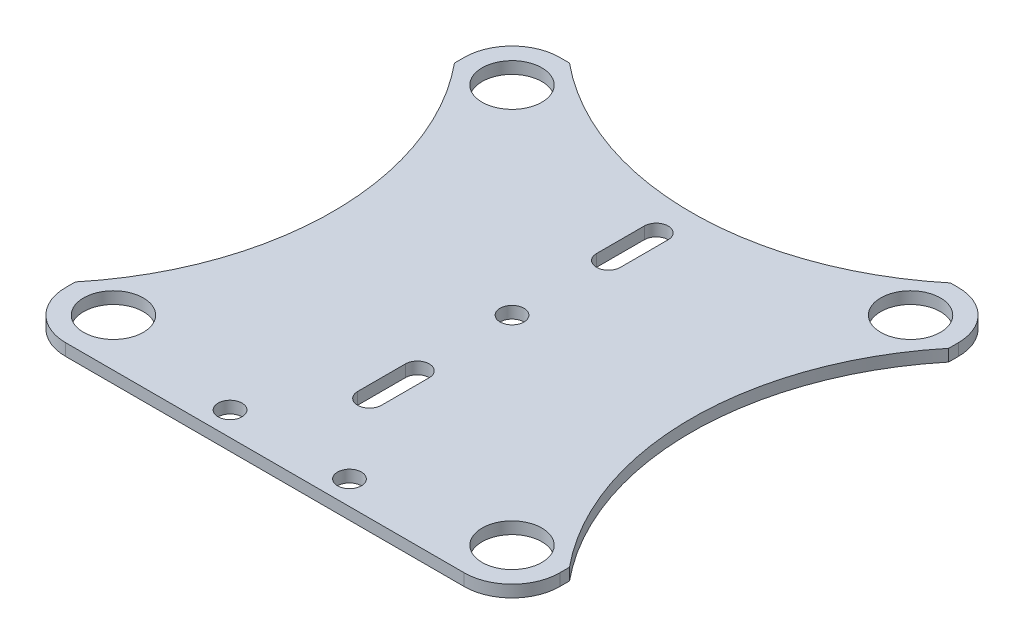
ISO-10303-21;
HEADER;
FILE_DESCRIPTION(('STEP AP214'),'2;1');
FILE_NAME('part.step','',(''),(''),'','','');
FILE_SCHEMA(('AUTOMOTIVE_DESIGN { 1 0 10303 214 1 1 1 1 }'));
ENDSEC;
DATA;
#1=APPLICATION_CONTEXT('core data for automotive mechanical design processes');
#2=APPLICATION_PROTOCOL_DEFINITION('international standard','automotive_design',2000,#1);
#3=PRODUCT_CONTEXT('',#1,'mechanical');
#4=PRODUCT('Part','Part','',(#3));
#5=PRODUCT_RELATED_PRODUCT_CATEGORY('part','',(#4));
#6=PRODUCT_DEFINITION_FORMATION('','',#4);
#7=PRODUCT_DEFINITION_CONTEXT('part definition',#1,'design');
#8=PRODUCT_DEFINITION('design','',#6,#7);
#9=PRODUCT_DEFINITION_SHAPE('','',#8);
#10=(LENGTH_UNIT() NAMED_UNIT(*) SI_UNIT(.MILLI.,.METRE.));
#11=(NAMED_UNIT(*) PLANE_ANGLE_UNIT() SI_UNIT($,.RADIAN.));
#12=(NAMED_UNIT(*) SI_UNIT($,.STERADIAN.) SOLID_ANGLE_UNIT());
#13=UNCERTAINTY_MEASURE_WITH_UNIT(LENGTH_MEASURE(1.E-05),#10,'distance_accuracy_value','');
#14=(GEOMETRIC_REPRESENTATION_CONTEXT(3) GLOBAL_UNCERTAINTY_ASSIGNED_CONTEXT((#13)) GLOBAL_UNIT_ASSIGNED_CONTEXT((#10,
#11,#12)) REPRESENTATION_CONTEXT('',''));
#15=CARTESIAN_POINT('',(0.,0.,0.));
#16=DIRECTION('',(0.,0.,1.));
#17=DIRECTION('',(1.,0.,0.));
#18=AXIS2_PLACEMENT_3D('',#15,#16,#17);
#19=CARTESIAN_POINT('',(80.,2.,0.));
#20=DIRECTION('',(0.,1.,0.));
#21=DIRECTION('',(0.,0.,1.));
#22=AXIS2_PLACEMENT_3D('',#19,#20,#21);
#23=PLANE('',#22);
#24=CARTESIAN_POINT('',(10.1477705862413,2.,37.3612752502187));
#25=DIRECTION('',(0.,1.,0.));
#26=DIRECTION('',(0.,0.,1.));
#27=AXIS2_PLACEMENT_3D('',#24,#25,#26);
#28=CIRCLE('',#27,2.);
#29=CARTESIAN_POINT('',(10.1477705862413,2.,39.3612752502187));
#30=VERTEX_POINT('',#29);
#31=EDGE_CURVE('E710',#30,#30,#28,.T.);
#32=ORIENTED_EDGE('',*,*,#31,.F.);
#33=EDGE_LOOP('',(#32));
#34=FACE_BOUND('',#33,.T.);
#35=CARTESIAN_POINT('',(33.3689380525236,2.,33.3689380525236));
#36=DIRECTION('',(0.,1.,0.));
#37=DIRECTION('',(0.,0.,1.));
#38=AXIS2_PLACEMENT_3D('',#35,#36,#37);
#39=CIRCLE('',#38,5.);
#40=CARTESIAN_POINT('',(33.3689380525236,2.,38.3689380525236));
#41=VERTEX_POINT('',#40);
#42=EDGE_CURVE('E722',#41,#41,#39,.T.);
#43=ORIENTED_EDGE('',*,*,#42,.F.);
#44=EDGE_LOOP('',(#43));
#45=FACE_BOUND('',#44,.T.);
#46=CARTESIAN_POINT('',(33.3689380525236,2.,-33.3689380525236));
#47=DIRECTION('',(0.,1.,0.));
#48=DIRECTION('',(0.,0.,1.));
#49=AXIS2_PLACEMENT_3D('',#46,#47,#48);
#50=CIRCLE('',#49,5.);
#51=CARTESIAN_POINT('',(33.3689380525236,2.,-28.3689380525236));
#52=VERTEX_POINT('',#51);
#53=EDGE_CURVE('E734',#52,#52,#50,.T.);
#54=ORIENTED_EDGE('',*,*,#53,.F.);
#55=EDGE_LOOP('',(#54));
#56=FACE_BOUND('',#55,.T.);
#57=DIRECTION('',(0.,0.,-1.));
#58=VECTOR('',#57,1.);
#59=CARTESIAN_POINT('',(2.14777058624126,2.,24.));
#60=LINE('',#59,#58);
#61=CARTESIAN_POINT('',(2.14777058624126,2.,24.));
#62=VERTEX_POINT('',#61);
#63=CARTESIAN_POINT('',(2.14777058624126,2.,16.));
#64=VERTEX_POINT('',#63);
#65=EDGE_CURVE('E190',#62,#64,#60,.T.);
#66=ORIENTED_EDGE('',*,*,#65,.F.);
#67=CARTESIAN_POINT('',(0.147770586241265,2.,24.));
#68=DIRECTION('',(0.,1.,0.));
#69=DIRECTION('',(0.,0.,1.));
#70=AXIS2_PLACEMENT_3D('',#67,#68,#69);
#71=CIRCLE('',#70,2.);
#72=CARTESIAN_POINT('',(-1.85222941375874,2.,24.));
#73=VERTEX_POINT('',#72);
#74=EDGE_CURVE('E182',#73,#62,#71,.T.);
#75=ORIENTED_EDGE('',*,*,#74,.F.);
#76=DIRECTION('',(0.,0.,1.));
#77=VECTOR('',#76,1.);
#78=CARTESIAN_POINT('',(-1.85222941375874,2.,24.));
#79=LINE('',#78,#77);
#80=CARTESIAN_POINT('',(-1.85222941375873,2.,16.));
#81=VERTEX_POINT('',#80);
#82=EDGE_CURVE('E205',#81,#73,#79,.T.);
#83=ORIENTED_EDGE('',*,*,#82,.F.);
#84=CARTESIAN_POINT('',(0.147770586241264,2.,16.));
#85=DIRECTION('',(0.,1.,0.));
#86=DIRECTION('',(0.,0.,1.));
#87=AXIS2_PLACEMENT_3D('',#84,#85,#86);
#88=CIRCLE('',#87,2.);
#89=EDGE_CURVE('E203',#64,#81,#88,.T.);
#90=ORIENTED_EDGE('',*,*,#89,.F.);
#91=EDGE_LOOP('',(#66,#75,#83,#90));
#92=FACE_BOUND('',#91,.T.);
#93=DIRECTION('',(0.,0.,1.));
#94=VECTOR('',#93,1.);
#95=CARTESIAN_POINT('',(-1.85222941375874,2.,-24.));
#96=LINE('',#95,#94);
#97=CARTESIAN_POINT('',(-1.85222941375874,2.,-24.));
#98=VERTEX_POINT('',#97);
#99=CARTESIAN_POINT('',(-1.85222941375874,2.,-16.));
#100=VERTEX_POINT('',#99);
#101=EDGE_CURVE('E223',#98,#100,#96,.T.);
#102=ORIENTED_EDGE('',*,*,#101,.F.);
#103=CARTESIAN_POINT('',(0.14777058624126,2.,-24.));
#104=DIRECTION('',(0.,1.,0.));
#105=DIRECTION('',(0.,0.,1.));
#106=AXIS2_PLACEMENT_3D('',#103,#104,#105);
#107=CIRCLE('',#106,2.);
#108=CARTESIAN_POINT('',(2.14777058624126,2.,-24.));
#109=VERTEX_POINT('',#108);
#110=EDGE_CURVE('E221',#109,#98,#107,.T.);
#111=ORIENTED_EDGE('',*,*,#110,.F.);
#112=DIRECTION('',(0.,0.,-1.));
#113=VECTOR('',#112,1.);
#114=CARTESIAN_POINT('',(2.14777058624126,2.,-24.));
#115=LINE('',#114,#113);
#116=CARTESIAN_POINT('',(2.14777058624126,2.,-16.));
#117=VERTEX_POINT('',#116);
#118=EDGE_CURVE('E229',#117,#109,#115,.T.);
#119=ORIENTED_EDGE('',*,*,#118,.F.);
#120=CARTESIAN_POINT('',(0.14777058624126,2.,-16.));
#121=DIRECTION('',(0.,1.,0.));
#122=DIRECTION('',(0.,0.,1.));
#123=AXIS2_PLACEMENT_3D('',#120,#121,#122);
#124=CIRCLE('',#123,2.);
#125=EDGE_CURVE('E226',#100,#117,#124,.T.);
#126=ORIENTED_EDGE('',*,*,#125,.F.);
#127=EDGE_LOOP('',(#102,#111,#119,#126));
#128=FACE_BOUND('',#127,.T.);
#129=CARTESIAN_POINT('',(80.,2.,0.));
#130=DIRECTION('',(0.,-1.,0.));
#131=DIRECTION('',(0.,0.,1.));
#132=AXIS2_PLACEMENT_3D('',#129,#130,#131);
#133=CIRCLE('',#132,50.);
#134=CARTESIAN_POINT('',(41.3689380525236,2.,31.7433623425472));
#135=VERTEX_POINT('',#134);
#136=CARTESIAN_POINT('',(41.3689380525236,2.,-31.7433623425472));
#137=VERTEX_POINT('',#136);
#138=EDGE_CURVE('E252',#135,#137,#133,.T.);
#139=ORIENTED_EDGE('',*,*,#138,.T.);
#140=DIRECTION('',(0.,0.,-1.));
#141=VECTOR('',#140,1.);
#142=CARTESIAN_POINT('',(41.3689380525236,2.,-31.7433623425472));
#143=LINE('',#142,#141);
#144=CARTESIAN_POINT('',(41.3689380525236,2.,-33.3689380525236));
#145=VERTEX_POINT('',#144);
#146=EDGE_CURVE('E255',#137,#145,#143,.T.);
#147=ORIENTED_EDGE('',*,*,#146,.T.);
#148=CARTESIAN_POINT('',(33.3689380525236,2.,-33.3689380525236));
#149=DIRECTION('',(0.,1.,0.));
#150=DIRECTION('',(0.,0.,-1.));
#151=AXIS2_PLACEMENT_3D('',#148,#149,#150);
#152=CIRCLE('',#151,8.);
#153=CARTESIAN_POINT('',(33.3689380525236,2.,-41.3689380525236));
#154=VERTEX_POINT('',#153);
#155=EDGE_CURVE('E258',#145,#154,#152,.T.);
#156=ORIENTED_EDGE('',*,*,#155,.T.);
#157=DIRECTION('',(-1.,0.,0.));
#158=VECTOR('',#157,1.);
#159=CARTESIAN_POINT('',(32.0389035150297,2.,-41.3689380525236));
#160=LINE('',#159,#158);
#161=CARTESIAN_POINT('',(32.0389035150297,2.,-41.3689380525236));
#162=VERTEX_POINT('',#161);
#163=EDGE_CURVE('E260',#154,#162,#160,.T.);
#164=ORIENTED_EDGE('',*,*,#163,.T.);
#165=CARTESIAN_POINT('',(0.147770586241252,2.,-79.9998635239701));
#166=DIRECTION('',(0.,-1.,0.));
#167=DIRECTION('',(0.,0.,1.));
#168=AXIS2_PLACEMENT_3D('',#165,#166,#167);
#169=CIRCLE('',#168,50.0938395639834);
#170=CARTESIAN_POINT('',(-31.7433623425472,2.,-41.3689380525236));
#171=VERTEX_POINT('',#170);
#172=EDGE_CURVE('E262',#162,#171,#169,.T.);
#173=ORIENTED_EDGE('',*,*,#172,.T.);
#174=DIRECTION('',(-1.,0.,0.));
#175=VECTOR('',#174,1.);
#176=CARTESIAN_POINT('',(-33.3689380525236,2.,-41.3689380525236));
#177=LINE('',#176,#175);
#178=CARTESIAN_POINT('',(-33.3689380525236,2.,-41.3689380525236));
#179=VERTEX_POINT('',#178);
#180=EDGE_CURVE('E264',#171,#179,#177,.T.);
#181=ORIENTED_EDGE('',*,*,#180,.T.);
#182=CARTESIAN_POINT('',(-33.3689380525236,2.,-33.3689380525236));
#183=DIRECTION('',(0.,1.,0.));
#184=DIRECTION('',(0.,0.,-1.));
#185=AXIS2_PLACEMENT_3D('',#182,#183,#184);
#186=CIRCLE('',#185,8.);
#187=CARTESIAN_POINT('',(-41.3689380525236,2.,-33.3689380525236));
#188=VERTEX_POINT('',#187);
#189=EDGE_CURVE('E266',#179,#188,#186,.T.);
#190=ORIENTED_EDGE('',*,*,#189,.T.);
#191=DIRECTION('',(0.,0.,1.));
#192=VECTOR('',#191,1.);
#193=CARTESIAN_POINT('',(-41.3689380525236,2.,-31.7433623425472));
#194=LINE('',#193,#192);
#195=CARTESIAN_POINT('',(-41.3689380525236,2.,-31.7433623425472));
#196=VERTEX_POINT('',#195);
#197=EDGE_CURVE('E268',#188,#196,#194,.T.);
#198=ORIENTED_EDGE('',*,*,#197,.T.);
#199=CARTESIAN_POINT('',(-80.,2.,0.));
#200=DIRECTION('',(0.,-1.,0.));
#201=DIRECTION('',(0.,0.,1.));
#202=AXIS2_PLACEMENT_3D('',#199,#200,#201);
#203=CIRCLE('',#202,50.);
#204=CARTESIAN_POINT('',(-41.3689380525236,2.,31.7433623425472));
#205=VERTEX_POINT('',#204);
#206=EDGE_CURVE('E270',#196,#205,#203,.T.);
#207=ORIENTED_EDGE('',*,*,#206,.T.);
#208=DIRECTION('',(0.,0.,1.));
#209=VECTOR('',#208,1.);
#210=CARTESIAN_POINT('',(-41.3689380525236,2.,33.3689380525236));
#211=LINE('',#210,#209);
#212=CARTESIAN_POINT('',(-41.3689380525236,2.,33.3689380525236));
#213=VERTEX_POINT('',#212);
#214=EDGE_CURVE('E272',#205,#213,#211,.T.);
#215=ORIENTED_EDGE('',*,*,#214,.T.);
#216=CARTESIAN_POINT('',(-33.3689380525236,2.,33.3689380525236));
#217=DIRECTION('',(0.,1.,0.));
#218=DIRECTION('',(0.,0.,1.));
#219=AXIS2_PLACEMENT_3D('',#216,#217,#218);
#220=CIRCLE('',#219,8.);
#221=CARTESIAN_POINT('',(-33.3689380525236,2.,41.3689380525236));
#222=VERTEX_POINT('',#221);
#223=EDGE_CURVE('E274',#213,#222,#220,.T.);
#224=ORIENTED_EDGE('',*,*,#223,.T.);
#225=DIRECTION('',(1.,0.,0.));
#226=VECTOR('',#225,1.);
#227=CARTESIAN_POINT('',(-33.3689380525236,2.,41.3689380525236));
#228=LINE('',#227,#226);
#229=CARTESIAN_POINT('',(33.3689380525236,2.,41.3689380525236));
#230=VERTEX_POINT('',#229);
#231=EDGE_CURVE('E276',#222,#230,#228,.T.);
#232=ORIENTED_EDGE('',*,*,#231,.T.);
#233=CARTESIAN_POINT('',(33.3689380525236,2.,33.3689380525236));
#234=DIRECTION('',(0.,1.,0.));
#235=DIRECTION('',(0.,0.,1.));
#236=AXIS2_PLACEMENT_3D('',#233,#234,#235);
#237=CIRCLE('',#236,8.);
#238=CARTESIAN_POINT('',(41.3689380525236,2.,33.3689380525236));
#239=VERTEX_POINT('',#238);
#240=EDGE_CURVE('E278',#230,#239,#237,.T.);
#241=ORIENTED_EDGE('',*,*,#240,.T.);
#242=DIRECTION('',(0.,0.,-1.));
#243=VECTOR('',#242,1.);
#244=CARTESIAN_POINT('',(41.3689380525236,2.,33.3689380525236));
#245=LINE('',#244,#243);
#246=EDGE_CURVE('E280',#239,#135,#245,.T.);
#247=ORIENTED_EDGE('',*,*,#246,.T.);
#248=EDGE_LOOP('',(#139,#147,#156,#164,#173,#181,#190,#198,#207,#215,#224,#232,#241,#247));
#249=FACE_BOUND('',#248,.T.);
#250=CARTESIAN_POINT('',(-33.3689380525236,2.,-33.3689380525236));
#251=DIRECTION('',(0.,1.,0.));
#252=DIRECTION('',(0.,0.,1.));
#253=AXIS2_PLACEMENT_3D('',#250,#251,#252);
#254=CIRCLE('',#253,5.);
#255=CARTESIAN_POINT('',(-33.3689380525236,2.,-28.3689380525236));
#256=VERTEX_POINT('',#255);
#257=EDGE_CURVE('E211',#256,#256,#254,.T.);
#258=ORIENTED_EDGE('',*,*,#257,.F.);
#259=EDGE_LOOP('',(#258));
#260=FACE_BOUND('',#259,.T.);
#261=CARTESIAN_POINT('',(-33.3689380525236,2.,33.3689380525236));
#262=DIRECTION('',(0.,1.,0.));
#263=DIRECTION('',(0.,0.,1.));
#264=AXIS2_PLACEMENT_3D('',#261,#262,#263);
#265=CIRCLE('',#264,5.);
#266=CARTESIAN_POINT('',(-33.3689380525236,2.,38.3689380525236));
#267=VERTEX_POINT('',#266);
#268=EDGE_CURVE('E728',#267,#267,#265,.T.);
#269=ORIENTED_EDGE('',*,*,#268,.F.);
#270=EDGE_LOOP('',(#269));
#271=FACE_BOUND('',#270,.T.);
#272=CARTESIAN_POINT('',(0.,2.,0.));
#273=DIRECTION('',(0.,1.,0.));
#274=DIRECTION('',(0.,0.,1.));
#275=AXIS2_PLACEMENT_3D('',#272,#273,#274);
#276=CIRCLE('',#275,2.);
#277=CARTESIAN_POINT('',(0.,2.,1.99999999999999));
#278=VERTEX_POINT('',#277);
#279=EDGE_CURVE('E716',#278,#278,#276,.T.);
#280=ORIENTED_EDGE('',*,*,#279,.F.);
#281=EDGE_LOOP('',(#280));
#282=FACE_BOUND('',#281,.T.);
#283=CARTESIAN_POINT('',(-9.85222941375873,2.,37.3612752502187));
#284=DIRECTION('',(0.,1.,0.));
#285=DIRECTION('',(0.,0.,-1.));
#286=AXIS2_PLACEMENT_3D('',#283,#284,#285);
#287=CIRCLE('',#286,2.);
#288=CARTESIAN_POINT('',(-9.85222941375873,2.,35.3612752502186));
#289=VERTEX_POINT('',#288);
#290=EDGE_CURVE('E701',#289,#289,#287,.T.);
#291=ORIENTED_EDGE('',*,*,#290,.F.);
#292=EDGE_LOOP('',(#291));
#293=FACE_BOUND('',#292,.T.);
#294=ADVANCED_FACE('F33',(#34,#45,#56,#92,#128,#249,#260,#271,#282,#293),#23,.T.);
#295=CARTESIAN_POINT('',(80.,0.,0.));
#296=DIRECTION('',(0.,1.,0.));
#297=DIRECTION('',(0.,0.,1.));
#298=AXIS2_PLACEMENT_3D('',#295,#296,#297);
#299=PLANE('',#298);
#300=CARTESIAN_POINT('',(0.14777058624126,0.,-24.));
#301=DIRECTION('',(0.,1.,0.));
#302=DIRECTION('',(0.,0.,1.));
#303=AXIS2_PLACEMENT_3D('',#300,#301,#302);
#304=CIRCLE('',#303,2.);
#305=CARTESIAN_POINT('',(2.14777058624126,0.,-24.));
#306=VERTEX_POINT('',#305);
#307=CARTESIAN_POINT('',(-1.85222941375874,0.,-24.));
#308=VERTEX_POINT('',#307);
#309=EDGE_CURVE('E198',#306,#308,#304,.T.);
#310=ORIENTED_EDGE('',*,*,#309,.T.);
#311=DIRECTION('',(0.,0.,1.));
#312=VECTOR('',#311,1.);
#313=CARTESIAN_POINT('',(-1.85222941375874,0.,-24.));
#314=LINE('',#313,#312);
#315=CARTESIAN_POINT('',(-1.85222941375874,0.,-16.));
#316=VERTEX_POINT('',#315);
#317=EDGE_CURVE('E234',#308,#316,#314,.T.);
#318=ORIENTED_EDGE('',*,*,#317,.T.);
#319=CARTESIAN_POINT('',(0.14777058624126,0.,-16.));
#320=DIRECTION('',(0.,1.,0.));
#321=DIRECTION('',(0.,0.,1.));
#322=AXIS2_PLACEMENT_3D('',#319,#320,#321);
#323=CIRCLE('',#322,2.);
#324=CARTESIAN_POINT('',(2.14777058624126,0.,-16.));
#325=VERTEX_POINT('',#324);
#326=EDGE_CURVE('E237',#316,#325,#323,.T.);
#327=ORIENTED_EDGE('',*,*,#326,.T.);
#328=DIRECTION('',(0.,0.,-1.));
#329=VECTOR('',#328,1.);
#330=CARTESIAN_POINT('',(2.14777058624126,0.,-24.));
#331=LINE('',#330,#329);
#332=EDGE_CURVE('E224',#325,#306,#331,.T.);
#333=ORIENTED_EDGE('',*,*,#332,.T.);
#334=EDGE_LOOP('',(#310,#318,#327,#333));
#335=FACE_BOUND('',#334,.T.);
#336=CARTESIAN_POINT('',(80.,0.,0.));
#337=DIRECTION('',(0.,-1.,0.));
#338=DIRECTION('',(0.,0.,1.));
#339=AXIS2_PLACEMENT_3D('',#336,#337,#338);
#340=CIRCLE('',#339,50.);
#341=CARTESIAN_POINT('',(41.3689380525236,0.,31.7433623425472));
#342=VERTEX_POINT('',#341);
#343=CARTESIAN_POINT('',(41.3689380525236,0.,-31.7433623425472));
#344=VERTEX_POINT('',#343);
#345=EDGE_CURVE('E251',#342,#344,#340,.T.);
#346=ORIENTED_EDGE('',*,*,#345,.F.);
#347=DIRECTION('',(0.,0.,-1.));
#348=VECTOR('',#347,1.);
#349=CARTESIAN_POINT('',(41.3689380525236,0.,33.3689380525236));
#350=LINE('',#349,#348);
#351=CARTESIAN_POINT('',(41.3689380525236,0.,33.3689380525236));
#352=VERTEX_POINT('',#351);
#353=EDGE_CURVE('E256',#352,#342,#350,.T.);
#354=ORIENTED_EDGE('',*,*,#353,.F.);
#355=CARTESIAN_POINT('',(33.3689380525236,0.,33.3689380525236));
#356=DIRECTION('',(0.,1.,0.));
#357=DIRECTION('',(0.,0.,1.));
#358=AXIS2_PLACEMENT_3D('',#355,#356,#357);
#359=CIRCLE('',#358,8.);
#360=CARTESIAN_POINT('',(33.3689380525236,0.,41.3689380525236));
#361=VERTEX_POINT('',#360);
#362=EDGE_CURVE('E308',#361,#352,#359,.T.);
#363=ORIENTED_EDGE('',*,*,#362,.F.);
#364=DIRECTION('',(1.,0.,0.));
#365=VECTOR('',#364,1.);
#366=CARTESIAN_POINT('',(32.0389035150297,0.,41.3689380525236));
#367=LINE('',#366,#365);
#368=CARTESIAN_POINT('',(-33.3689380525236,0.,41.3689380525236));
#369=VERTEX_POINT('',#368);
#370=EDGE_CURVE('E306',#369,#361,#367,.T.);
#371=ORIENTED_EDGE('',*,*,#370,.F.);
#372=CARTESIAN_POINT('',(-33.3689380525236,0.,33.3689380525236));
#373=DIRECTION('',(0.,1.,0.));
#374=DIRECTION('',(0.,0.,1.));
#375=AXIS2_PLACEMENT_3D('',#372,#373,#374);
#376=CIRCLE('',#375,8.);
#377=CARTESIAN_POINT('',(-41.3689380525236,0.,33.3689380525236));
#378=VERTEX_POINT('',#377);
#379=EDGE_CURVE('E303',#378,#369,#376,.T.);
#380=ORIENTED_EDGE('',*,*,#379,.F.);
#381=DIRECTION('',(0.,0.,1.));
#382=VECTOR('',#381,1.);
#383=CARTESIAN_POINT('',(-41.3689380525236,0.,33.3689380525236));
#384=LINE('',#383,#382);
#385=CARTESIAN_POINT('',(-41.3689380525236,0.,31.7433623425472));
#386=VERTEX_POINT('',#385);
#387=EDGE_CURVE('E301',#386,#378,#384,.T.);
#388=ORIENTED_EDGE('',*,*,#387,.F.);
#389=CARTESIAN_POINT('',(-80.,0.,0.));
#390=DIRECTION('',(0.,-1.,0.));
#391=DIRECTION('',(0.,0.,1.));
#392=AXIS2_PLACEMENT_3D('',#389,#390,#391);
#393=CIRCLE('',#392,50.);
#394=CARTESIAN_POINT('',(-41.3689380525236,0.,-31.7433623425472));
#395=VERTEX_POINT('',#394);
#396=EDGE_CURVE('E299',#395,#386,#393,.T.);
#397=ORIENTED_EDGE('',*,*,#396,.F.);
#398=DIRECTION('',(0.,0.,1.));
#399=VECTOR('',#398,1.);
#400=CARTESIAN_POINT('',(-41.3689380525236,0.,-31.7433623425472));
#401=LINE('',#400,#399);
#402=CARTESIAN_POINT('',(-41.3689380525236,0.,-33.3689380525236));
#403=VERTEX_POINT('',#402);
#404=EDGE_CURVE('E297',#403,#395,#401,.T.);
#405=ORIENTED_EDGE('',*,*,#404,.F.);
#406=CARTESIAN_POINT('',(-33.3689380525236,0.,-33.3689380525236));
#407=DIRECTION('',(0.,1.,0.));
#408=DIRECTION('',(0.,0.,-1.));
#409=AXIS2_PLACEMENT_3D('',#406,#407,#408);
#410=CIRCLE('',#409,8.);
#411=CARTESIAN_POINT('',(-33.3689380525236,0.,-41.3689380525236));
#412=VERTEX_POINT('',#411);
#413=EDGE_CURVE('E295',#412,#403,#410,.T.);
#414=ORIENTED_EDGE('',*,*,#413,.F.);
#415=DIRECTION('',(-1.,0.,0.));
#416=VECTOR('',#415,1.);
#417=CARTESIAN_POINT('',(-33.3689380525236,0.,-41.3689380525236));
#418=LINE('',#417,#416);
#419=CARTESIAN_POINT('',(-31.7433623425472,0.,-41.3689380525236));
#420=VERTEX_POINT('',#419);
#421=EDGE_CURVE('E293',#420,#412,#418,.T.);
#422=ORIENTED_EDGE('',*,*,#421,.F.);
#423=CARTESIAN_POINT('',(0.147770586241252,0.,-79.9998635239701));
#424=DIRECTION('',(0.,-1.,0.));
#425=DIRECTION('',(0.,0.,1.));
#426=AXIS2_PLACEMENT_3D('',#423,#424,#425);
#427=CIRCLE('',#426,50.0938395639834);
#428=CARTESIAN_POINT('',(32.0389035150297,0.,-41.3689380525236));
#429=VERTEX_POINT('',#428);
#430=EDGE_CURVE('E291',#429,#420,#427,.T.);
#431=ORIENTED_EDGE('',*,*,#430,.F.);
#432=DIRECTION('',(-1.,0.,0.));
#433=VECTOR('',#432,1.);
#434=CARTESIAN_POINT('',(32.0389035150297,0.,-41.3689380525236));
#435=LINE('',#434,#433);
#436=CARTESIAN_POINT('',(33.3689380525236,0.,-41.3689380525236));
#437=VERTEX_POINT('',#436);
#438=EDGE_CURVE('E289',#437,#429,#435,.T.);
#439=ORIENTED_EDGE('',*,*,#438,.F.);
#440=CARTESIAN_POINT('',(33.3689380525236,0.,-33.3689380525236));
#441=DIRECTION('',(0.,1.,0.));
#442=DIRECTION('',(0.,0.,-1.));
#443=AXIS2_PLACEMENT_3D('',#440,#441,#442);
#444=CIRCLE('',#443,8.);
#445=CARTESIAN_POINT('',(41.3689380525236,0.,-33.3689380525236));
#446=VERTEX_POINT('',#445);
#447=EDGE_CURVE('E287',#446,#437,#444,.T.);
#448=ORIENTED_EDGE('',*,*,#447,.F.);
#449=DIRECTION('',(0.,0.,-1.));
#450=VECTOR('',#449,1.);
#451=CARTESIAN_POINT('',(41.3689380525236,0.,-31.7433623425472));
#452=LINE('',#451,#450);
#453=EDGE_CURVE('E285',#344,#446,#452,.T.);
#454=ORIENTED_EDGE('',*,*,#453,.F.);
#455=EDGE_LOOP('',(#346,#354,#363,#371,#380,#388,#397,#405,#414,#422,#431,#439,#448,#454));
#456=FACE_BOUND('',#455,.T.);
#457=CARTESIAN_POINT('',(0.147770586241265,0.,24.));
#458=DIRECTION('',(0.,1.,0.));
#459=DIRECTION('',(0.,0.,1.));
#460=AXIS2_PLACEMENT_3D('',#457,#458,#459);
#461=CIRCLE('',#460,2.);
#462=CARTESIAN_POINT('',(-1.85222941375873,0.,24.));
#463=VERTEX_POINT('',#462);
#464=CARTESIAN_POINT('',(2.14777058624126,0.,24.));
#465=VERTEX_POINT('',#464);
#466=EDGE_CURVE('E56',#463,#465,#461,.T.);
#467=ORIENTED_EDGE('',*,*,#466,.T.);
#468=DIRECTION('',(0.,0.,-1.));
#469=VECTOR('',#468,1.);
#470=CARTESIAN_POINT('',(2.14777058624126,0.,24.));
#471=LINE('',#470,#469);
#472=CARTESIAN_POINT('',(2.14777058624126,0.,16.));
#473=VERTEX_POINT('',#472);
#474=EDGE_CURVE('E197',#465,#473,#471,.T.);
#475=ORIENTED_EDGE('',*,*,#474,.T.);
#476=CARTESIAN_POINT('',(0.147770586241264,0.,16.));
#477=DIRECTION('',(0.,1.,0.));
#478=DIRECTION('',(0.,0.,1.));
#479=AXIS2_PLACEMENT_3D('',#476,#477,#478);
#480=CIRCLE('',#479,2.);
#481=CARTESIAN_POINT('',(-1.85222941375874,0.,16.));
#482=VERTEX_POINT('',#481);
#483=EDGE_CURVE('E213',#473,#482,#480,.T.);
#484=ORIENTED_EDGE('',*,*,#483,.T.);
#485=DIRECTION('',(0.,0.,1.));
#486=VECTOR('',#485,1.);
#487=CARTESIAN_POINT('',(-1.85222941375874,0.,24.));
#488=LINE('',#487,#486);
#489=EDGE_CURVE('E191',#482,#463,#488,.T.);
#490=ORIENTED_EDGE('',*,*,#489,.T.);
#491=EDGE_LOOP('',(#467,#475,#484,#490));
#492=FACE_BOUND('',#491,.T.);
#493=CARTESIAN_POINT('',(-33.3689380525236,0.,-33.3689380525236));
#494=DIRECTION('',(0.,1.,0.));
#495=DIRECTION('',(0.,0.,1.));
#496=AXIS2_PLACEMENT_3D('',#493,#494,#495);
#497=CIRCLE('',#496,5.);
#498=CARTESIAN_POINT('',(-33.3689380525236,0.,-28.3689380525236));
#499=VERTEX_POINT('',#498);
#500=EDGE_CURVE('E737',#499,#499,#497,.T.);
#501=ORIENTED_EDGE('',*,*,#500,.T.);
#502=EDGE_LOOP('',(#501));
#503=FACE_BOUND('',#502,.T.);
#504=CARTESIAN_POINT('',(33.3689380525236,0.,-33.3689380525236));
#505=DIRECTION('',(0.,1.,0.));
#506=DIRECTION('',(0.,0.,1.));
#507=AXIS2_PLACEMENT_3D('',#504,#505,#506);
#508=CIRCLE('',#507,5.);
#509=CARTESIAN_POINT('',(33.3689380525236,0.,-28.3689380525236));
#510=VERTEX_POINT('',#509);
#511=EDGE_CURVE('E731',#510,#510,#508,.T.);
#512=ORIENTED_EDGE('',*,*,#511,.T.);
#513=EDGE_LOOP('',(#512));
#514=FACE_BOUND('',#513,.T.);
#515=CARTESIAN_POINT('',(-33.3689380525236,0.,33.3689380525236));
#516=DIRECTION('',(0.,1.,0.));
#517=DIRECTION('',(0.,0.,1.));
#518=AXIS2_PLACEMENT_3D('',#515,#516,#517);
#519=CIRCLE('',#518,5.);
#520=CARTESIAN_POINT('',(-33.3689380525236,0.,38.3689380525236));
#521=VERTEX_POINT('',#520);
#522=EDGE_CURVE('E725',#521,#521,#519,.T.);
#523=ORIENTED_EDGE('',*,*,#522,.T.);
#524=EDGE_LOOP('',(#523));
#525=FACE_BOUND('',#524,.T.);
#526=CARTESIAN_POINT('',(33.3689380525236,0.,33.3689380525236));
#527=DIRECTION('',(0.,1.,0.));
#528=DIRECTION('',(0.,0.,1.));
#529=AXIS2_PLACEMENT_3D('',#526,#527,#528);
#530=CIRCLE('',#529,5.);
#531=CARTESIAN_POINT('',(33.3689380525236,0.,38.3689380525236));
#532=VERTEX_POINT('',#531);
#533=EDGE_CURVE('E719',#532,#532,#530,.T.);
#534=ORIENTED_EDGE('',*,*,#533,.T.);
#535=EDGE_LOOP('',(#534));
#536=FACE_BOUND('',#535,.T.);
#537=CARTESIAN_POINT('',(0.,0.,0.));
#538=DIRECTION('',(0.,1.,0.));
#539=DIRECTION('',(0.,0.,1.));
#540=AXIS2_PLACEMENT_3D('',#537,#538,#539);
#541=CIRCLE('',#540,2.);
#542=CARTESIAN_POINT('',(0.,0.,1.99999999999999));
#543=VERTEX_POINT('',#542);
#544=EDGE_CURVE('E713',#543,#543,#541,.T.);
#545=ORIENTED_EDGE('',*,*,#544,.T.);
#546=EDGE_LOOP('',(#545));
#547=FACE_BOUND('',#546,.T.);
#548=CARTESIAN_POINT('',(10.1477705862413,0.,37.3612752502187));
#549=DIRECTION('',(0.,1.,0.));
#550=DIRECTION('',(0.,0.,1.));
#551=AXIS2_PLACEMENT_3D('',#548,#549,#550);
#552=CIRCLE('',#551,2.);
#553=CARTESIAN_POINT('',(10.1477705862413,0.,39.3612752502187));
#554=VERTEX_POINT('',#553);
#555=EDGE_CURVE('E707',#554,#554,#552,.T.);
#556=ORIENTED_EDGE('',*,*,#555,.T.);
#557=EDGE_LOOP('',(#556));
#558=FACE_BOUND('',#557,.T.);
#559=CARTESIAN_POINT('',(-9.85222941375873,0.,37.3612752502187));
#560=DIRECTION('',(0.,1.,0.));
#561=DIRECTION('',(0.,0.,-1.));
#562=AXIS2_PLACEMENT_3D('',#559,#560,#561);
#563=CIRCLE('',#562,2.);
#564=CARTESIAN_POINT('',(-9.85222941375873,0.,35.3612752502186));
#565=VERTEX_POINT('',#564);
#566=EDGE_CURVE('E704',#565,#565,#563,.T.);
#567=ORIENTED_EDGE('',*,*,#566,.T.);
#568=EDGE_LOOP('',(#567));
#569=FACE_BOUND('',#568,.T.);
#570=ADVANCED_FACE('F356',(#335,#456,#492,#503,#514,#525,#536,#547,#558,#569),#299,.F.);
#571=CARTESIAN_POINT('',(80.,2.,0.));
#572=DIRECTION('',(0.,-1.,0.));
#573=DIRECTION('',(0.,0.,-1.));
#574=AXIS2_PLACEMENT_3D('',#571,#572,#573);
#575=CYLINDRICAL_SURFACE('',#574,50.);
#576=ORIENTED_EDGE('',*,*,#345,.T.);
#577=DIRECTION('',(0.,-1.,0.));
#578=VECTOR('',#577,1.);
#579=CARTESIAN_POINT('',(41.3689380525236,2.,-31.7433623425472));
#580=LINE('',#579,#578);
#581=EDGE_CURVE('E11',#137,#344,#580,.T.);
#582=ORIENTED_EDGE('',*,*,#581,.F.);
#583=ORIENTED_EDGE('',*,*,#138,.F.);
#584=DIRECTION('',(0.,-1.,0.));
#585=VECTOR('',#584,1.);
#586=CARTESIAN_POINT('',(41.3689380525236,2.,31.7433623425472));
#587=LINE('',#586,#585);
#588=EDGE_CURVE('E282',#135,#342,#587,.T.);
#589=ORIENTED_EDGE('',*,*,#588,.T.);
#590=EDGE_LOOP('',(#576,#582,#583,#589));
#591=FACE_BOUND('',#590,.T.);
#592=ADVANCED_FACE('F35',(#591),#575,.F.);
#593=CARTESIAN_POINT('',(41.3689380525236,2.,-31.7433623425472));
#594=DIRECTION('',(-1.,0.,0.));
#595=DIRECTION('',(0.,0.,1.));
#596=AXIS2_PLACEMENT_3D('',#593,#594,#595);
#597=PLANE('',#596);
#598=ORIENTED_EDGE('',*,*,#453,.T.);
#599=DIRECTION('',(0.,-1.,0.));
#600=VECTOR('',#599,1.);
#601=CARTESIAN_POINT('',(41.3689380525236,2.,-33.3689380525236));
#602=LINE('',#601,#600);
#603=EDGE_CURVE('E41',#145,#446,#602,.T.);
#604=ORIENTED_EDGE('',*,*,#603,.F.);
#605=ORIENTED_EDGE('',*,*,#146,.F.);
#606=ORIENTED_EDGE('',*,*,#581,.T.);
#607=EDGE_LOOP('',(#598,#604,#605,#606));
#608=FACE_BOUND('',#607,.T.);
#609=ADVANCED_FACE('F374',(#608),#597,.F.);
#610=CARTESIAN_POINT('',(33.3689380525236,2.,-33.3689380525236));
#611=DIRECTION('',(0.,-1.,0.));
#612=DIRECTION('',(0.,0.,-1.));
#613=AXIS2_PLACEMENT_3D('',#610,#611,#612);
#614=CYLINDRICAL_SURFACE('',#613,8.);
#615=ORIENTED_EDGE('',*,*,#447,.T.);
#616=DIRECTION('',(0.,-1.,0.));
#617=VECTOR('',#616,1.);
#618=CARTESIAN_POINT('',(33.3689380525236,2.,-41.3689380525236));
#619=LINE('',#618,#617);
#620=EDGE_CURVE('E343',#154,#437,#619,.T.);
#621=ORIENTED_EDGE('',*,*,#620,.F.);
#622=ORIENTED_EDGE('',*,*,#155,.F.);
#623=ORIENTED_EDGE('',*,*,#603,.T.);
#624=EDGE_LOOP('',(#615,#621,#622,#623));
#625=FACE_BOUND('',#624,.T.);
#626=ADVANCED_FACE('F350',(#625),#614,.T.);
#627=CARTESIAN_POINT('',(32.0389035150297,2.,-41.3689380525236));
#628=DIRECTION('',(0.,0.,1.));
#629=DIRECTION('',(1.,0.,0.));
#630=AXIS2_PLACEMENT_3D('',#627,#628,#629);
#631=PLANE('',#630);
#632=ORIENTED_EDGE('',*,*,#438,.T.);
#633=DIRECTION('',(0.,-1.,0.));
#634=VECTOR('',#633,1.);
#635=CARTESIAN_POINT('',(32.0389035150297,2.,-41.3689380525236));
#636=LINE('',#635,#634);
#637=EDGE_CURVE('E340',#162,#429,#636,.T.);
#638=ORIENTED_EDGE('',*,*,#637,.F.);
#639=ORIENTED_EDGE('',*,*,#163,.F.);
#640=ORIENTED_EDGE('',*,*,#620,.T.);
#641=EDGE_LOOP('',(#632,#638,#639,#640));
#642=FACE_BOUND('',#641,.T.);
#643=ADVANCED_FACE('F362',(#642),#631,.F.);
#644=CARTESIAN_POINT('',(0.147770586241252,2.,-79.9998635239701));
#645=DIRECTION('',(0.,-1.,0.));
#646=DIRECTION('',(0.,0.,-1.));
#647=AXIS2_PLACEMENT_3D('',#644,#645,#646);
#648=CYLINDRICAL_SURFACE('',#647,50.0938395639834);
#649=ORIENTED_EDGE('',*,*,#430,.T.);
#650=DIRECTION('',(0.,-1.,0.));
#651=VECTOR('',#650,1.);
#652=CARTESIAN_POINT('',(-31.7433623425472,2.,-41.3689380525236));
#653=LINE('',#652,#651);
#654=EDGE_CURVE('E337',#171,#420,#653,.T.);
#655=ORIENTED_EDGE('',*,*,#654,.F.);
#656=ORIENTED_EDGE('',*,*,#172,.F.);
#657=ORIENTED_EDGE('',*,*,#637,.T.);
#658=EDGE_LOOP('',(#649,#655,#656,#657));
#659=FACE_BOUND('',#658,.T.);
#660=ADVANCED_FACE('F366',(#659),#648,.F.);
#661=CARTESIAN_POINT('',(-33.3689380525236,2.,-41.3689380525236));
#662=DIRECTION('',(0.,0.,1.));
#663=DIRECTION('',(1.,0.,0.));
#664=AXIS2_PLACEMENT_3D('',#661,#662,#663);
#665=PLANE('',#664);
#666=ORIENTED_EDGE('',*,*,#421,.T.);
#667=DIRECTION('',(0.,-1.,0.));
#668=VECTOR('',#667,1.);
#669=CARTESIAN_POINT('',(-33.3689380525236,2.,-41.3689380525236));
#670=LINE('',#669,#668);
#671=EDGE_CURVE('E334',#179,#412,#670,.T.);
#672=ORIENTED_EDGE('',*,*,#671,.F.);
#673=ORIENTED_EDGE('',*,*,#180,.F.);
#674=ORIENTED_EDGE('',*,*,#654,.T.);
#675=EDGE_LOOP('',(#666,#672,#673,#674));
#676=FACE_BOUND('',#675,.T.);
#677=ADVANCED_FACE('F416',(#676),#665,.F.);
#678=CARTESIAN_POINT('',(-33.3689380525236,2.,-33.3689380525236));
#679=DIRECTION('',(0.,-1.,0.));
#680=DIRECTION('',(0.,0.,-1.));
#681=AXIS2_PLACEMENT_3D('',#678,#679,#680);
#682=CYLINDRICAL_SURFACE('',#681,8.);
#683=ORIENTED_EDGE('',*,*,#413,.T.);
#684=DIRECTION('',(0.,-1.,0.));
#685=VECTOR('',#684,1.);
#686=CARTESIAN_POINT('',(-41.3689380525236,2.,-33.3689380525236));
#687=LINE('',#686,#685);
#688=EDGE_CURVE('E331',#188,#403,#687,.T.);
#689=ORIENTED_EDGE('',*,*,#688,.F.);
#690=ORIENTED_EDGE('',*,*,#189,.F.);
#691=ORIENTED_EDGE('',*,*,#671,.T.);
#692=EDGE_LOOP('',(#683,#689,#690,#691));
#693=FACE_BOUND('',#692,.T.);
#694=ADVANCED_FACE('F414',(#693),#682,.T.);
#695=CARTESIAN_POINT('',(-41.3689380525236,2.,-31.7433623425472));
#696=DIRECTION('',(1.,0.,0.));
#697=DIRECTION('',(0.,0.,-1.));
#698=AXIS2_PLACEMENT_3D('',#695,#696,#697);
#699=PLANE('',#698);
#700=ORIENTED_EDGE('',*,*,#404,.T.);
#701=DIRECTION('',(0.,-1.,0.));
#702=VECTOR('',#701,1.);
#703=CARTESIAN_POINT('',(-41.3689380525236,2.,-31.7433623425472));
#704=LINE('',#703,#702);
#705=EDGE_CURVE('E328',#196,#395,#704,.T.);
#706=ORIENTED_EDGE('',*,*,#705,.F.);
#707=ORIENTED_EDGE('',*,*,#197,.F.);
#708=ORIENTED_EDGE('',*,*,#688,.T.);
#709=EDGE_LOOP('',(#700,#706,#707,#708));
#710=FACE_BOUND('',#709,.T.);
#711=ADVANCED_FACE('F410',(#710),#699,.F.);
#712=CARTESIAN_POINT('',(-80.,2.,0.));
#713=DIRECTION('',(0.,-1.,0.));
#714=DIRECTION('',(0.,0.,-1.));
#715=AXIS2_PLACEMENT_3D('',#712,#713,#714);
#716=CYLINDRICAL_SURFACE('',#715,50.);
#717=ORIENTED_EDGE('',*,*,#396,.T.);
#718=DIRECTION('',(0.,-1.,0.));
#719=VECTOR('',#718,1.);
#720=CARTESIAN_POINT('',(-41.3689380525236,2.,31.7433623425472));
#721=LINE('',#720,#719);
#722=EDGE_CURVE('E325',#205,#386,#721,.T.);
#723=ORIENTED_EDGE('',*,*,#722,.F.);
#724=ORIENTED_EDGE('',*,*,#206,.F.);
#725=ORIENTED_EDGE('',*,*,#705,.T.);
#726=EDGE_LOOP('',(#717,#723,#724,#725));
#727=FACE_BOUND('',#726,.T.);
#728=ADVANCED_FACE('F405',(#727),#716,.F.);
#729=CARTESIAN_POINT('',(-41.3689380525236,2.,33.3689380525236));
#730=DIRECTION('',(1.,0.,0.));
#731=DIRECTION('',(0.,0.,-1.));
#732=AXIS2_PLACEMENT_3D('',#729,#730,#731);
#733=PLANE('',#732);
#734=ORIENTED_EDGE('',*,*,#387,.T.);
#735=DIRECTION('',(0.,-1.,0.));
#736=VECTOR('',#735,1.);
#737=CARTESIAN_POINT('',(-41.3689380525236,2.,33.3689380525236));
#738=LINE('',#737,#736);
#739=EDGE_CURVE('E322',#213,#378,#738,.T.);
#740=ORIENTED_EDGE('',*,*,#739,.F.);
#741=ORIENTED_EDGE('',*,*,#214,.F.);
#742=ORIENTED_EDGE('',*,*,#722,.T.);
#743=EDGE_LOOP('',(#734,#740,#741,#742));
#744=FACE_BOUND('',#743,.T.);
#745=ADVANCED_FACE('F399',(#744),#733,.F.);
#746=CARTESIAN_POINT('',(-33.3689380525236,2.,33.3689380525236));
#747=DIRECTION('',(0.,-1.,0.));
#748=DIRECTION('',(0.,0.,-1.));
#749=AXIS2_PLACEMENT_3D('',#746,#747,#748);
#750=CYLINDRICAL_SURFACE('',#749,8.);
#751=ORIENTED_EDGE('',*,*,#379,.T.);
#752=DIRECTION('',(0.,-1.,0.));
#753=VECTOR('',#752,1.);
#754=CARTESIAN_POINT('',(-33.3689380525236,2.,41.3689380525236));
#755=LINE('',#754,#753);
#756=EDGE_CURVE('E319',#222,#369,#755,.T.);
#757=ORIENTED_EDGE('',*,*,#756,.F.);
#758=ORIENTED_EDGE('',*,*,#223,.F.);
#759=ORIENTED_EDGE('',*,*,#739,.T.);
#760=EDGE_LOOP('',(#751,#757,#758,#759));
#761=FACE_BOUND('',#760,.T.);
#762=ADVANCED_FACE('F394',(#761),#750,.T.);
#763=CARTESIAN_POINT('',(32.0389035150297,2.,41.3689380525236));
#764=DIRECTION('',(0.,0.,-1.));
#765=DIRECTION('',(-1.,0.,0.));
#766=AXIS2_PLACEMENT_3D('',#763,#764,#765);
#767=PLANE('',#766);
#768=ORIENTED_EDGE('',*,*,#370,.T.);
#769=DIRECTION('',(0.,-1.,0.));
#770=VECTOR('',#769,1.);
#771=CARTESIAN_POINT('',(33.3689380525236,2.,41.3689380525236));
#772=LINE('',#771,#770);
#773=EDGE_CURVE('E316',#230,#361,#772,.T.);
#774=ORIENTED_EDGE('',*,*,#773,.F.);
#775=ORIENTED_EDGE('',*,*,#231,.F.);
#776=ORIENTED_EDGE('',*,*,#756,.T.);
#777=EDGE_LOOP('',(#768,#774,#775,#776));
#778=FACE_BOUND('',#777,.T.);
#779=ADVANCED_FACE('F389',(#778),#767,.F.);
#780=CARTESIAN_POINT('',(33.3689380525236,2.,33.3689380525236));
#781=DIRECTION('',(0.,-1.,0.));
#782=DIRECTION('',(0.,0.,-1.));
#783=AXIS2_PLACEMENT_3D('',#780,#781,#782);
#784=CYLINDRICAL_SURFACE('',#783,8.);
#785=ORIENTED_EDGE('',*,*,#362,.T.);
#786=DIRECTION('',(0.,-1.,0.));
#787=VECTOR('',#786,1.);
#788=CARTESIAN_POINT('',(41.3689380525236,2.,33.3689380525236));
#789=LINE('',#788,#787);
#790=EDGE_CURVE('E313',#239,#352,#789,.T.);
#791=ORIENTED_EDGE('',*,*,#790,.F.);
#792=ORIENTED_EDGE('',*,*,#240,.F.);
#793=ORIENTED_EDGE('',*,*,#773,.T.);
#794=EDGE_LOOP('',(#785,#791,#792,#793));
#795=FACE_BOUND('',#794,.T.);
#796=ADVANCED_FACE('F385',(#795),#784,.T.);
#797=CARTESIAN_POINT('',(41.3689380525236,2.,33.3689380525236));
#798=DIRECTION('',(-1.,0.,0.));
#799=DIRECTION('',(0.,0.,1.));
#800=AXIS2_PLACEMENT_3D('',#797,#798,#799);
#801=PLANE('',#800);
#802=ORIENTED_EDGE('',*,*,#353,.T.);
#803=ORIENTED_EDGE('',*,*,#588,.F.);
#804=ORIENTED_EDGE('',*,*,#246,.F.);
#805=ORIENTED_EDGE('',*,*,#790,.T.);
#806=EDGE_LOOP('',(#802,#803,#804,#805));
#807=FACE_BOUND('',#806,.T.);
#808=ADVANCED_FACE('F380',(#807),#801,.F.);
#809=CARTESIAN_POINT('',(0.14777058624126,2.,-24.));
#810=DIRECTION('',(0.,-1.,0.));
#811=DIRECTION('',(0.,0.,-1.));
#812=AXIS2_PLACEMENT_3D('',#809,#810,#811);
#813=CYLINDRICAL_SURFACE('',#812,2.);
#814=ORIENTED_EDGE('',*,*,#309,.F.);
#815=DIRECTION('',(0.,-1.,0.));
#816=VECTOR('',#815,1.);
#817=CARTESIAN_POINT('',(2.14777058624126,2.,-24.));
#818=LINE('',#817,#816);
#819=EDGE_CURVE('E231',#109,#306,#818,.T.);
#820=ORIENTED_EDGE('',*,*,#819,.F.);
#821=ORIENTED_EDGE('',*,*,#110,.T.);
#822=DIRECTION('',(0.,-1.,0.));
#823=VECTOR('',#822,1.);
#824=CARTESIAN_POINT('',(-1.85222941375874,2.,-24.));
#825=LINE('',#824,#823);
#826=EDGE_CURVE('E248',#98,#308,#825,.T.);
#827=ORIENTED_EDGE('',*,*,#826,.T.);
#828=EDGE_LOOP('',(#814,#820,#821,#827));
#829=FACE_BOUND('',#828,.T.);
#830=ADVANCED_FACE('F436',(#829),#813,.F.);
#831=CARTESIAN_POINT('',(-1.85222941375874,2.,-24.));
#832=DIRECTION('',(1.,0.,0.));
#833=DIRECTION('',(0.,0.,-1.));
#834=AXIS2_PLACEMENT_3D('',#831,#832,#833);
#835=PLANE('',#834);
#836=ORIENTED_EDGE('',*,*,#317,.F.);
#837=ORIENTED_EDGE('',*,*,#826,.F.);
#838=ORIENTED_EDGE('',*,*,#101,.T.);
#839=DIRECTION('',(0.,-1.,0.));
#840=VECTOR('',#839,1.);
#841=CARTESIAN_POINT('',(-1.85222941375874,2.,-16.));
#842=LINE('',#841,#840);
#843=EDGE_CURVE('E246',#100,#316,#842,.T.);
#844=ORIENTED_EDGE('',*,*,#843,.T.);
#845=EDGE_LOOP('',(#836,#837,#838,#844));
#846=FACE_BOUND('',#845,.T.);
#847=ADVANCED_FACE('F486',(#846),#835,.T.);
#848=CARTESIAN_POINT('',(0.14777058624126,2.,-16.));
#849=DIRECTION('',(0.,-1.,0.));
#850=DIRECTION('',(0.,0.,-1.));
#851=AXIS2_PLACEMENT_3D('',#848,#849,#850);
#852=CYLINDRICAL_SURFACE('',#851,2.);
#853=ORIENTED_EDGE('',*,*,#326,.F.);
#854=ORIENTED_EDGE('',*,*,#843,.F.);
#855=ORIENTED_EDGE('',*,*,#125,.T.);
#856=DIRECTION('',(0.,-1.,0.));
#857=VECTOR('',#856,1.);
#858=CARTESIAN_POINT('',(2.14777058624126,2.,-16.));
#859=LINE('',#858,#857);
#860=EDGE_CURVE('E244',#117,#325,#859,.T.);
#861=ORIENTED_EDGE('',*,*,#860,.T.);
#862=EDGE_LOOP('',(#853,#854,#855,#861));
#863=FACE_BOUND('',#862,.T.);
#864=ADVANCED_FACE('F493',(#863),#852,.F.);
#865=CARTESIAN_POINT('',(2.14777058624126,2.,-24.));
#866=DIRECTION('',(-1.,0.,0.));
#867=DIRECTION('',(0.,0.,1.));
#868=AXIS2_PLACEMENT_3D('',#865,#866,#867);
#869=PLANE('',#868);
#870=ORIENTED_EDGE('',*,*,#332,.F.);
#871=ORIENTED_EDGE('',*,*,#860,.F.);
#872=ORIENTED_EDGE('',*,*,#118,.T.);
#873=ORIENTED_EDGE('',*,*,#819,.T.);
#874=EDGE_LOOP('',(#870,#871,#872,#873));
#875=FACE_BOUND('',#874,.T.);
#876=ADVANCED_FACE('F500',(#875),#869,.T.);
#877=CARTESIAN_POINT('',(0.147770586241265,2.,24.));
#878=DIRECTION('',(0.,-1.,0.));
#879=DIRECTION('',(0.,0.,-1.));
#880=AXIS2_PLACEMENT_3D('',#877,#878,#879);
#881=CYLINDRICAL_SURFACE('',#880,2.);
#882=ORIENTED_EDGE('',*,*,#466,.F.);
#883=DIRECTION('',(0.,-1.,0.));
#884=VECTOR('',#883,1.);
#885=CARTESIAN_POINT('',(-1.85222941375874,2.,24.));
#886=LINE('',#885,#884);
#887=EDGE_CURVE('E186',#73,#463,#886,.T.);
#888=ORIENTED_EDGE('',*,*,#887,.F.);
#889=ORIENTED_EDGE('',*,*,#74,.T.);
#890=DIRECTION('',(0.,-1.,0.));
#891=VECTOR('',#890,1.);
#892=CARTESIAN_POINT('',(2.14777058624126,2.,24.));
#893=LINE('',#892,#891);
#894=EDGE_CURVE('E185',#62,#465,#893,.T.);
#895=ORIENTED_EDGE('',*,*,#894,.T.);
#896=EDGE_LOOP('',(#882,#888,#889,#895));
#897=FACE_BOUND('',#896,.T.);
#898=ADVANCED_FACE('F184',(#897),#881,.F.);
#899=CARTESIAN_POINT('',(2.14777058624126,2.,24.));
#900=DIRECTION('',(-1.,0.,0.));
#901=DIRECTION('',(0.,0.,1.));
#902=AXIS2_PLACEMENT_3D('',#899,#900,#901);
#903=PLANE('',#902);
#904=ORIENTED_EDGE('',*,*,#474,.F.);
#905=ORIENTED_EDGE('',*,*,#894,.F.);
#906=ORIENTED_EDGE('',*,*,#65,.T.);
#907=DIRECTION('',(0.,-1.,0.));
#908=VECTOR('',#907,1.);
#909=CARTESIAN_POINT('',(2.14777058624126,2.,16.));
#910=LINE('',#909,#908);
#911=EDGE_CURVE('E199',#64,#473,#910,.T.);
#912=ORIENTED_EDGE('',*,*,#911,.T.);
#913=EDGE_LOOP('',(#904,#905,#906,#912));
#914=FACE_BOUND('',#913,.T.);
#915=ADVANCED_FACE('F194',(#914),#903,.T.);
#916=CARTESIAN_POINT('',(0.147770586241264,2.,16.));
#917=DIRECTION('',(0.,-1.,0.));
#918=DIRECTION('',(0.,0.,-1.));
#919=AXIS2_PLACEMENT_3D('',#916,#917,#918);
#920=CYLINDRICAL_SURFACE('',#919,2.);
#921=ORIENTED_EDGE('',*,*,#483,.F.);
#922=ORIENTED_EDGE('',*,*,#911,.F.);
#923=ORIENTED_EDGE('',*,*,#89,.T.);
#924=DIRECTION('',(0.,-1.,0.));
#925=VECTOR('',#924,1.);
#926=CARTESIAN_POINT('',(-1.85222941375874,2.,16.));
#927=LINE('',#926,#925);
#928=EDGE_CURVE('E48',#81,#482,#927,.T.);
#929=ORIENTED_EDGE('',*,*,#928,.T.);
#930=EDGE_LOOP('',(#921,#922,#923,#929));
#931=FACE_BOUND('',#930,.T.);
#932=ADVANCED_FACE('F521',(#931),#920,.F.);
#933=CARTESIAN_POINT('',(-1.85222941375874,2.,24.));
#934=DIRECTION('',(1.,0.,0.));
#935=DIRECTION('',(0.,0.,-1.));
#936=AXIS2_PLACEMENT_3D('',#933,#934,#935);
#937=PLANE('',#936);
#938=ORIENTED_EDGE('',*,*,#489,.F.);
#939=ORIENTED_EDGE('',*,*,#928,.F.);
#940=ORIENTED_EDGE('',*,*,#82,.T.);
#941=ORIENTED_EDGE('',*,*,#887,.T.);
#942=EDGE_LOOP('',(#938,#939,#940,#941));
#943=FACE_BOUND('',#942,.T.);
#944=ADVANCED_FACE('F528',(#943),#937,.T.);
#945=CARTESIAN_POINT('',(-33.3689380525236,2.,-33.3689380525236));
#946=DIRECTION('',(0.,-1.,0.));
#947=DIRECTION('',(0.,0.,-1.));
#948=AXIS2_PLACEMENT_3D('',#945,#946,#947);
#949=CYLINDRICAL_SURFACE('',#948,5.);
#950=ORIENTED_EDGE('',*,*,#257,.T.);
#951=EDGE_LOOP('',(#950));
#952=FACE_BOUND('',#951,.T.);
#953=ORIENTED_EDGE('',*,*,#500,.F.);
#954=EDGE_LOOP('',(#953));
#955=FACE_BOUND('',#954,.T.);
#956=ADVANCED_FACE('F536',(#952,#955),#949,.F.);
#957=CARTESIAN_POINT('',(33.3689380525236,2.,-33.3689380525236));
#958=DIRECTION('',(0.,-1.,0.));
#959=DIRECTION('',(0.,0.,-1.));
#960=AXIS2_PLACEMENT_3D('',#957,#958,#959);
#961=CYLINDRICAL_SURFACE('',#960,5.);
#962=ORIENTED_EDGE('',*,*,#53,.T.);
#963=EDGE_LOOP('',(#962));
#964=FACE_BOUND('',#963,.T.);
#965=ORIENTED_EDGE('',*,*,#511,.F.);
#966=EDGE_LOOP('',(#965));
#967=FACE_BOUND('',#966,.T.);
#968=ADVANCED_FACE('F543',(#964,#967),#961,.F.);
#969=CARTESIAN_POINT('',(-33.3689380525236,2.,33.3689380525236));
#970=DIRECTION('',(0.,-1.,0.));
#971=DIRECTION('',(0.,0.,-1.));
#972=AXIS2_PLACEMENT_3D('',#969,#970,#971);
#973=CYLINDRICAL_SURFACE('',#972,5.);
#974=ORIENTED_EDGE('',*,*,#268,.T.);
#975=EDGE_LOOP('',(#974));
#976=FACE_BOUND('',#975,.T.);
#977=ORIENTED_EDGE('',*,*,#522,.F.);
#978=EDGE_LOOP('',(#977));
#979=FACE_BOUND('',#978,.T.);
#980=ADVANCED_FACE('F551',(#976,#979),#973,.F.);
#981=CARTESIAN_POINT('',(33.3689380525236,2.,33.3689380525236));
#982=DIRECTION('',(0.,-1.,0.));
#983=DIRECTION('',(0.,0.,-1.));
#984=AXIS2_PLACEMENT_3D('',#981,#982,#983);
#985=CYLINDRICAL_SURFACE('',#984,5.);
#986=ORIENTED_EDGE('',*,*,#42,.T.);
#987=EDGE_LOOP('',(#986));
#988=FACE_BOUND('',#987,.T.);
#989=ORIENTED_EDGE('',*,*,#533,.F.);
#990=EDGE_LOOP('',(#989));
#991=FACE_BOUND('',#990,.T.);
#992=ADVANCED_FACE('F559',(#988,#991),#985,.F.);
#993=CARTESIAN_POINT('',(0.,2.,0.));
#994=DIRECTION('',(0.,-1.,0.));
#995=DIRECTION('',(0.,0.,-1.));
#996=AXIS2_PLACEMENT_3D('',#993,#994,#995);
#997=CYLINDRICAL_SURFACE('',#996,2.);
#998=ORIENTED_EDGE('',*,*,#279,.T.);
#999=EDGE_LOOP('',(#998));
#1000=FACE_BOUND('',#999,.T.);
#1001=ORIENTED_EDGE('',*,*,#544,.F.);
#1002=EDGE_LOOP('',(#1001));
#1003=FACE_BOUND('',#1002,.T.);
#1004=ADVANCED_FACE('F567',(#1000,#1003),#997,.F.);
#1005=CARTESIAN_POINT('',(10.1477705862413,2.,37.3612752502187));
#1006=DIRECTION('',(0.,-1.,0.));
#1007=DIRECTION('',(0.,0.,-1.));
#1008=AXIS2_PLACEMENT_3D('',#1005,#1006,#1007);
#1009=CYLINDRICAL_SURFACE('',#1008,2.);
#1010=ORIENTED_EDGE('',*,*,#31,.T.);
#1011=EDGE_LOOP('',(#1010));
#1012=FACE_BOUND('',#1011,.T.);
#1013=ORIENTED_EDGE('',*,*,#555,.F.);
#1014=EDGE_LOOP('',(#1013));
#1015=FACE_BOUND('',#1014,.T.);
#1016=ADVANCED_FACE('F575',(#1012,#1015),#1009,.F.);
#1017=CARTESIAN_POINT('',(-9.85222941375873,2.,37.3612752502187));
#1018=DIRECTION('',(0.,-1.,0.));
#1019=DIRECTION('',(0.,0.,-1.));
#1020=AXIS2_PLACEMENT_3D('',#1017,#1018,#1019);
#1021=CYLINDRICAL_SURFACE('',#1020,2.);
#1022=ORIENTED_EDGE('',*,*,#290,.T.);
#1023=EDGE_LOOP('',(#1022));
#1024=FACE_BOUND('',#1023,.T.);
#1025=ORIENTED_EDGE('',*,*,#566,.F.);
#1026=EDGE_LOOP('',(#1025));
#1027=FACE_BOUND('',#1026,.T.);
#1028=ADVANCED_FACE('F583',(#1024,#1027),#1021,.F.);
#1029=CLOSED_SHELL('',(#294,#570,#592,#609,#626,#643,#660,#677,#694,#711,#728,#745,#762,#779,
#796,#808,#830,#847,#864,#876,#898,#915,#932,#944,#956,#968,#980,#992,#1004,#1016,#1028));
#1030=MANIFOLD_SOLID_BREP('B2',#1029);
#1031=ADVANCED_BREP_SHAPE_REPRESENTATION('',(#18,#1030),#14);
#1032=SHAPE_DEFINITION_REPRESENTATION(#9,#1031);
ENDSEC;
END-ISO-10303-21;
